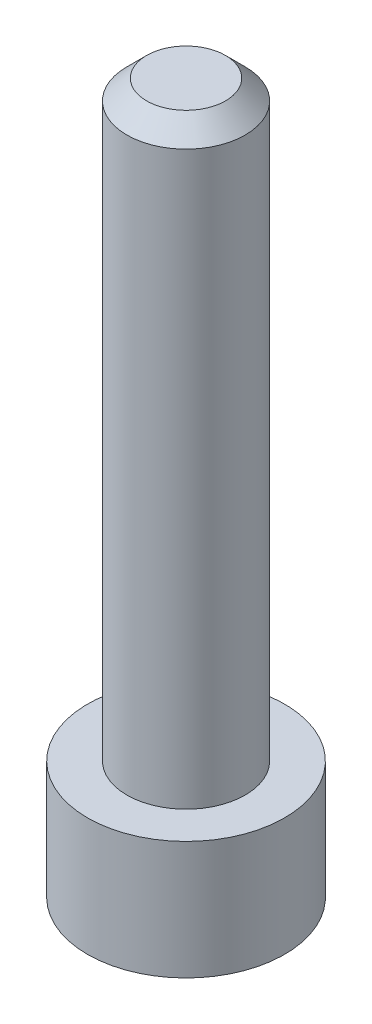
ISO-10303-21;
HEADER;
FILE_DESCRIPTION(('STEP AP214'),'2;1');
FILE_NAME('part.step','',(''),(''),'','','');
FILE_SCHEMA(('AUTOMOTIVE_DESIGN { 1 0 10303 214 1 1 1 1 }'));
ENDSEC;
DATA;
#1=APPLICATION_CONTEXT('core data for automotive mechanical design processes');
#2=APPLICATION_PROTOCOL_DEFINITION('international standard','automotive_design',2000,#1);
#3=PRODUCT_CONTEXT('',#1,'mechanical');
#4=PRODUCT('Part','Part','',(#3));
#5=PRODUCT_RELATED_PRODUCT_CATEGORY('part','',(#4));
#6=PRODUCT_DEFINITION_FORMATION('','',#4);
#7=PRODUCT_DEFINITION_CONTEXT('part definition',#1,'design');
#8=PRODUCT_DEFINITION('design','',#6,#7);
#9=PRODUCT_DEFINITION_SHAPE('','',#8);
#10=(LENGTH_UNIT() NAMED_UNIT(*) SI_UNIT(.MILLI.,.METRE.));
#11=(NAMED_UNIT(*) PLANE_ANGLE_UNIT() SI_UNIT($,.RADIAN.));
#12=(NAMED_UNIT(*) SI_UNIT($,.STERADIAN.) SOLID_ANGLE_UNIT());
#13=UNCERTAINTY_MEASURE_WITH_UNIT(LENGTH_MEASURE(1.E-05),#10,'distance_accuracy_value','');
#14=(GEOMETRIC_REPRESENTATION_CONTEXT(3) GLOBAL_UNCERTAINTY_ASSIGNED_CONTEXT((#13)) GLOBAL_UNIT_ASSIGNED_CONTEXT((#10,
#11,#12)) REPRESENTATION_CONTEXT('',''));
#15=CARTESIAN_POINT('',(0.,0.,0.));
#16=DIRECTION('',(0.,0.,1.));
#17=DIRECTION('',(1.,0.,0.));
#18=AXIS2_PLACEMENT_3D('',#15,#16,#17);
#19=CARTESIAN_POINT('',(0.,0.,0.));
#20=DIRECTION('',(0.,-1.,0.));
#21=DIRECTION('',(0.,0.,-1.));
#22=AXIS2_PLACEMENT_3D('',#19,#20,#21);
#23=PLANE('',#22);
#24=CARTESIAN_POINT('',(0.,0.,0.));
#25=DIRECTION('',(0.,-1.,0.));
#26=DIRECTION('',(0.,0.,-1.));
#27=AXIS2_PLACEMENT_3D('',#24,#25,#26);
#28=CIRCLE('',#27,0.999999999999999);
#29=CARTESIAN_POINT('',(0.,0.,-0.999999999999999));
#30=VERTEX_POINT('',#29);
#31=EDGE_CURVE('E36',#30,#30,#28,.F.);
#32=ORIENTED_EDGE('',*,*,#31,.T.);
#33=EDGE_LOOP('',(#32));
#34=FACE_BOUND('',#33,.T.);
#35=ADVANCED_FACE('F29',(#34),#23,.F.);
#36=CARTESIAN_POINT('',(0.,0.,0.));
#37=DIRECTION('',(0.,1.,0.));
#38=DIRECTION('',(0.,0.,1.));
#39=AXIS2_PLACEMENT_3D('',#36,#37,#38);
#40=CYLINDRICAL_SURFACE('',#39,1.5);
#41=CARTESIAN_POINT('',(0.,-0.500000000000003,0.));
#42=DIRECTION('',(0.,-1.,0.));
#43=DIRECTION('',(0.,0.,-1.));
#44=AXIS2_PLACEMENT_3D('',#41,#42,#43);
#45=CIRCLE('',#44,1.5);
#46=CARTESIAN_POINT('',(0.,-0.500000000000003,-1.5));
#47=VERTEX_POINT('',#46);
#48=EDGE_CURVE('E10',#47,#47,#45,.T.);
#49=ORIENTED_EDGE('',*,*,#48,.T.);
#50=EDGE_LOOP('',(#49));
#51=FACE_BOUND('',#50,.T.);
#52=CARTESIAN_POINT('',(0.,-15.,0.));
#53=DIRECTION('',(0.,1.,0.));
#54=DIRECTION('',(0.,0.,1.));
#55=AXIS2_PLACEMENT_3D('',#52,#53,#54);
#56=CIRCLE('',#55,1.5);
#57=CARTESIAN_POINT('',(0.,-15.,1.5));
#58=VERTEX_POINT('',#57);
#59=EDGE_CURVE('E40',#58,#58,#56,.T.);
#60=ORIENTED_EDGE('',*,*,#59,.T.);
#61=EDGE_LOOP('',(#60));
#62=FACE_BOUND('',#61,.T.);
#63=ADVANCED_FACE('F67',(#51,#62),#40,.T.);
#64=CARTESIAN_POINT('',(1.5,-15.,0.));
#65=DIRECTION('',(0.,-1.,0.));
#66=DIRECTION('',(0.,0.,-1.));
#67=AXIS2_PLACEMENT_3D('',#64,#65,#66);
#68=PLANE('',#67);
#69=ORIENTED_EDGE('',*,*,#59,.F.);
#70=EDGE_LOOP('',(#69));
#71=FACE_BOUND('',#70,.T.);
#72=CARTESIAN_POINT('',(0.,-15.,0.));
#73=DIRECTION('',(0.,1.,0.));
#74=DIRECTION('',(0.,0.,1.));
#75=AXIS2_PLACEMENT_3D('',#72,#73,#74);
#76=CIRCLE('',#75,2.5);
#77=CARTESIAN_POINT('',(0.,-15.,2.5));
#78=VERTEX_POINT('',#77);
#79=EDGE_CURVE('E44',#78,#78,#76,.T.);
#80=ORIENTED_EDGE('',*,*,#79,.T.);
#81=EDGE_LOOP('',(#80));
#82=FACE_BOUND('',#81,.T.);
#83=ADVANCED_FACE('F63',(#71,#82),#68,.F.);
#84=CARTESIAN_POINT('',(0.,0.,0.));
#85=DIRECTION('',(0.,1.,0.));
#86=DIRECTION('',(0.,0.,1.));
#87=AXIS2_PLACEMENT_3D('',#84,#85,#86);
#88=CYLINDRICAL_SURFACE('',#87,2.5);
#89=ORIENTED_EDGE('',*,*,#79,.F.);
#90=EDGE_LOOP('',(#89));
#91=FACE_BOUND('',#90,.T.);
#92=CARTESIAN_POINT('',(0.,-18.,0.));
#93=DIRECTION('',(0.,1.,0.));
#94=DIRECTION('',(0.,0.,1.));
#95=AXIS2_PLACEMENT_3D('',#92,#93,#94);
#96=CIRCLE('',#95,2.5);
#97=CARTESIAN_POINT('',(0.,-18.,2.5));
#98=VERTEX_POINT('',#97);
#99=EDGE_CURVE('E49',#98,#98,#96,.T.);
#100=ORIENTED_EDGE('',*,*,#99,.T.);
#101=EDGE_LOOP('',(#100));
#102=FACE_BOUND('',#101,.T.);
#103=ADVANCED_FACE('F53',(#91,#102),#88,.T.);
#104=CARTESIAN_POINT('',(2.5,-18.,0.));
#105=DIRECTION('',(0.,1.,0.));
#106=DIRECTION('',(0.,0.,1.));
#107=AXIS2_PLACEMENT_3D('',#104,#105,#106);
#108=PLANE('',#107);
#109=ORIENTED_EDGE('',*,*,#99,.F.);
#110=EDGE_LOOP('',(#109));
#111=FACE_BOUND('',#110,.T.);
#112=ADVANCED_FACE('F55',(#111),#108,.F.);
#113=CARTESIAN_POINT('',(0.,0.,0.));
#114=DIRECTION('',(0.,-1.,0.));
#115=DIRECTION('',(0.,0.,-1.));
#116=AXIS2_PLACEMENT_3D('',#113,#114,#115);
#117=CONICAL_SURFACE('',#116,0.999999999999999,0.785398163397447);
#118=ORIENTED_EDGE('',*,*,#48,.F.);
#119=EDGE_LOOP('',(#118));
#120=FACE_BOUND('',#119,.T.);
#121=ORIENTED_EDGE('',*,*,#31,.F.);
#122=EDGE_LOOP('',(#121));
#123=FACE_BOUND('',#122,.T.);
#124=ADVANCED_FACE('F31',(#120,#123),#117,.T.);
#125=CLOSED_SHELL('',(#35,#63,#83,#103,#112,#124));
#126=MANIFOLD_SOLID_BREP('B2',#125);
#127=ADVANCED_BREP_SHAPE_REPRESENTATION('',(#18,#126),#14);
#128=SHAPE_DEFINITION_REPRESENTATION(#9,#127);
ENDSEC;
END-ISO-10303-21;
